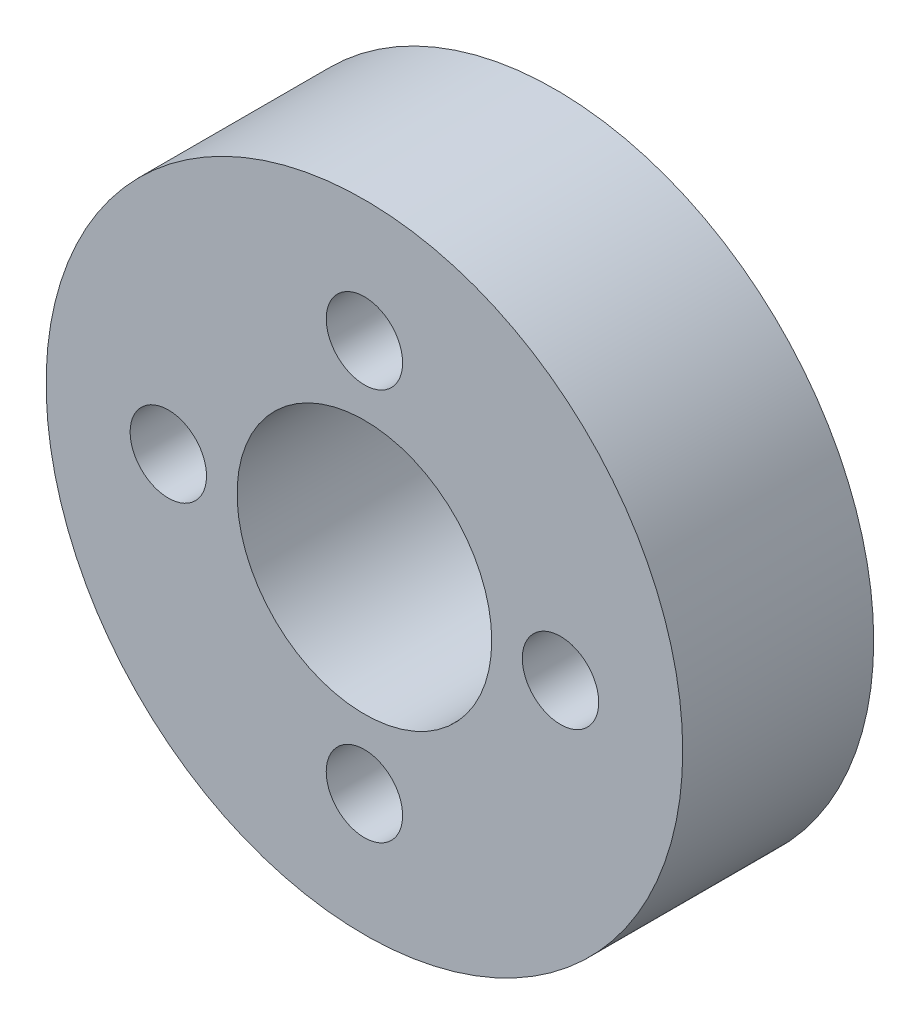
ISO-10303-21;
HEADER;
FILE_DESCRIPTION(('STEP AP214'),'2;1');
FILE_NAME('part.step','',(''),(''),'','','');
FILE_SCHEMA(('AUTOMOTIVE_DESIGN { 1 0 10303 214 1 1 1 1 }'));
ENDSEC;
DATA;
#1=APPLICATION_CONTEXT('core data for automotive mechanical design processes');
#2=APPLICATION_PROTOCOL_DEFINITION('international standard','automotive_design',2000,#1);
#3=PRODUCT_CONTEXT('',#1,'mechanical');
#4=PRODUCT('Part','Part','',(#3));
#5=PRODUCT_RELATED_PRODUCT_CATEGORY('part','',(#4));
#6=PRODUCT_DEFINITION_FORMATION('','',#4);
#7=PRODUCT_DEFINITION_CONTEXT('part definition',#1,'design');
#8=PRODUCT_DEFINITION('design','',#6,#7);
#9=PRODUCT_DEFINITION_SHAPE('','',#8);
#10=(LENGTH_UNIT() NAMED_UNIT(*) SI_UNIT(.MILLI.,.METRE.));
#11=(NAMED_UNIT(*) PLANE_ANGLE_UNIT() SI_UNIT($,.RADIAN.));
#12=(NAMED_UNIT(*) SI_UNIT($,.STERADIAN.) SOLID_ANGLE_UNIT());
#13=UNCERTAINTY_MEASURE_WITH_UNIT(LENGTH_MEASURE(1.E-05),#10,'distance_accuracy_value','');
#14=(GEOMETRIC_REPRESENTATION_CONTEXT(3) GLOBAL_UNCERTAINTY_ASSIGNED_CONTEXT((#13)) GLOBAL_UNIT_ASSIGNED_CONTEXT((#10,
#11,#12)) REPRESENTATION_CONTEXT('',''));
#15=CARTESIAN_POINT('',(0.,0.,0.));
#16=DIRECTION('',(0.,0.,1.));
#17=DIRECTION('',(1.,0.,0.));
#18=AXIS2_PLACEMENT_3D('',#15,#16,#17);
#19=CARTESIAN_POINT('',(0.,0.,9.525));
#20=DIRECTION('',(0.,0.,1.));
#21=DIRECTION('',(1.,0.,0.));
#22=AXIS2_PLACEMENT_3D('',#19,#20,#21);
#23=PLANE('',#22);
#24=CARTESIAN_POINT('',(-9.779,0.,9.525));
#25=DIRECTION('',(0.,0.,1.));
#26=DIRECTION('',(0.,1.,0.));
#27=AXIS2_PLACEMENT_3D('',#24,#25,#26);
#28=CIRCLE('',#27,1.905);
#29=CARTESIAN_POINT('',(-9.77900000000001,1.90499999999997,9.525));
#30=VERTEX_POINT('',#29);
#31=EDGE_CURVE('E68',#30,#30,#28,.T.);
#32=ORIENTED_EDGE('',*,*,#31,.F.);
#33=EDGE_LOOP('',(#32));
#34=FACE_BOUND('',#33,.T.);
#35=CARTESIAN_POINT('',(0.,-9.779,9.525));
#36=DIRECTION('',(0.,0.,1.));
#37=DIRECTION('',(-1.,0.,0.));
#38=AXIS2_PLACEMENT_3D('',#35,#36,#37);
#39=CIRCLE('',#38,1.905);
#40=CARTESIAN_POINT('',(-1.905,-9.779,9.525));
#41=VERTEX_POINT('',#40);
#42=EDGE_CURVE('E62',#41,#41,#39,.T.);
#43=ORIENTED_EDGE('',*,*,#42,.F.);
#44=EDGE_LOOP('',(#43));
#45=FACE_BOUND('',#44,.T.);
#46=CARTESIAN_POINT('',(9.779,1.02429588037641E-13,9.525));
#47=DIRECTION('',(0.,0.,1.));
#48=DIRECTION('',(0.,-1.,0.));
#49=AXIS2_PLACEMENT_3D('',#46,#47,#48);
#50=CIRCLE('',#49,1.905);
#51=CARTESIAN_POINT('',(9.77900000000002,-1.9049999999999,9.525));
#52=VERTEX_POINT('',#51);
#53=EDGE_CURVE('E56',#52,#52,#50,.T.);
#54=ORIENTED_EDGE('',*,*,#53,.F.);
#55=EDGE_LOOP('',(#54));
#56=FACE_BOUND('',#55,.T.);
#57=CARTESIAN_POINT('',(0.,9.779,9.525));
#58=DIRECTION('',(0.,0.,1.));
#59=DIRECTION('',(1.,0.,0.));
#60=AXIS2_PLACEMENT_3D('',#57,#58,#59);
#61=CIRCLE('',#60,1.905);
#62=CARTESIAN_POINT('',(1.905,9.779,9.525));
#63=VERTEX_POINT('',#62);
#64=EDGE_CURVE('E50',#63,#63,#61,.T.);
#65=ORIENTED_EDGE('',*,*,#64,.F.);
#66=EDGE_LOOP('',(#65));
#67=FACE_BOUND('',#66,.T.);
#68=CARTESIAN_POINT('',(0.,0.,9.525));
#69=DIRECTION('',(0.,0.,1.));
#70=DIRECTION('',(1.,0.,0.));
#71=AXIS2_PLACEMENT_3D('',#68,#69,#70);
#72=CIRCLE('',#71,15.875);
#73=CARTESIAN_POINT('',(15.875,0.,9.525));
#74=VERTEX_POINT('',#73);
#75=EDGE_CURVE('E10',#74,#74,#72,.T.);
#76=ORIENTED_EDGE('',*,*,#75,.T.);
#77=EDGE_LOOP('',(#76));
#78=FACE_BOUND('',#77,.T.);
#79=CARTESIAN_POINT('',(0.,0.,9.525));
#80=DIRECTION('',(0.,0.,1.));
#81=DIRECTION('',(1.,0.,0.));
#82=AXIS2_PLACEMENT_3D('',#79,#80,#81);
#83=CIRCLE('',#82,6.35);
#84=CARTESIAN_POINT('',(6.35,0.,9.525));
#85=VERTEX_POINT('',#84);
#86=EDGE_CURVE('E42',#85,#85,#83,.T.);
#87=ORIENTED_EDGE('',*,*,#86,.F.);
#88=EDGE_LOOP('',(#87));
#89=FACE_BOUND('',#88,.T.);
#90=ADVANCED_FACE('F31',(#34,#45,#56,#67,#78,#89),#23,.T.);
#91=CARTESIAN_POINT('',(0.,0.,0.));
#92=DIRECTION('',(0.,0.,1.));
#93=DIRECTION('',(1.,0.,0.));
#94=AXIS2_PLACEMENT_3D('',#91,#92,#93);
#95=PLANE('',#94);
#96=CARTESIAN_POINT('',(-9.779,0.,0.));
#97=DIRECTION('',(0.,0.,1.));
#98=DIRECTION('',(0.,1.,0.));
#99=AXIS2_PLACEMENT_3D('',#96,#97,#98);
#100=CIRCLE('',#99,1.905);
#101=CARTESIAN_POINT('',(-9.77900000000001,1.90499999999997,0.));
#102=VERTEX_POINT('',#101);
#103=EDGE_CURVE('E53',#102,#102,#100,.T.);
#104=ORIENTED_EDGE('',*,*,#103,.T.);
#105=EDGE_LOOP('',(#104));
#106=FACE_BOUND('',#105,.T.);
#107=CARTESIAN_POINT('',(0.,-9.779,0.));
#108=DIRECTION('',(0.,0.,1.));
#109=DIRECTION('',(-1.,0.,0.));
#110=AXIS2_PLACEMENT_3D('',#107,#108,#109);
#111=CIRCLE('',#110,1.905);
#112=CARTESIAN_POINT('',(-1.905,-9.779,0.));
#113=VERTEX_POINT('',#112);
#114=EDGE_CURVE('E65',#113,#113,#111,.T.);
#115=ORIENTED_EDGE('',*,*,#114,.T.);
#116=EDGE_LOOP('',(#115));
#117=FACE_BOUND('',#116,.T.);
#118=CARTESIAN_POINT('',(9.779,1.02429588037641E-13,0.));
#119=DIRECTION('',(0.,0.,1.));
#120=DIRECTION('',(0.,-1.,0.));
#121=AXIS2_PLACEMENT_3D('',#118,#119,#120);
#122=CIRCLE('',#121,1.905);
#123=CARTESIAN_POINT('',(9.77900000000002,-1.9049999999999,0.));
#124=VERTEX_POINT('',#123);
#125=EDGE_CURVE('E59',#124,#124,#122,.T.);
#126=ORIENTED_EDGE('',*,*,#125,.T.);
#127=EDGE_LOOP('',(#126));
#128=FACE_BOUND('',#127,.T.);
#129=CARTESIAN_POINT('',(0.,9.779,0.));
#130=DIRECTION('',(0.,0.,1.));
#131=DIRECTION('',(1.,0.,0.));
#132=AXIS2_PLACEMENT_3D('',#129,#130,#131);
#133=CIRCLE('',#132,1.905);
#134=CARTESIAN_POINT('',(1.905,9.779,0.));
#135=VERTEX_POINT('',#134);
#136=EDGE_CURVE('E47',#135,#135,#133,.T.);
#137=ORIENTED_EDGE('',*,*,#136,.T.);
#138=EDGE_LOOP('',(#137));
#139=FACE_BOUND('',#138,.T.);
#140=CARTESIAN_POINT('',(0.,0.,0.));
#141=DIRECTION('',(0.,0.,1.));
#142=DIRECTION('',(1.,0.,0.));
#143=AXIS2_PLACEMENT_3D('',#140,#141,#142);
#144=CIRCLE('',#143,15.875);
#145=CARTESIAN_POINT('',(15.875,0.,0.));
#146=VERTEX_POINT('',#145);
#147=EDGE_CURVE('E35',#146,#146,#144,.T.);
#148=ORIENTED_EDGE('',*,*,#147,.F.);
#149=EDGE_LOOP('',(#148));
#150=FACE_BOUND('',#149,.T.);
#151=CARTESIAN_POINT('',(0.,0.,0.));
#152=DIRECTION('',(0.,0.,1.));
#153=DIRECTION('',(1.,0.,0.));
#154=AXIS2_PLACEMENT_3D('',#151,#152,#153);
#155=CIRCLE('',#154,6.35);
#156=CARTESIAN_POINT('',(6.35,0.,0.));
#157=VERTEX_POINT('',#156);
#158=EDGE_CURVE('E44',#157,#157,#155,.T.);
#159=ORIENTED_EDGE('',*,*,#158,.T.);
#160=EDGE_LOOP('',(#159));
#161=FACE_BOUND('',#160,.T.);
#162=ADVANCED_FACE('F74',(#106,#117,#128,#139,#150,#161),#95,.F.);
#163=CARTESIAN_POINT('',(0.,0.,9.525));
#164=DIRECTION('',(0.,0.,-1.));
#165=DIRECTION('',(-1.,0.,0.));
#166=AXIS2_PLACEMENT_3D('',#163,#164,#165);
#167=CYLINDRICAL_SURFACE('',#166,15.875);
#168=ORIENTED_EDGE('',*,*,#75,.F.);
#169=EDGE_LOOP('',(#168));
#170=FACE_BOUND('',#169,.T.);
#171=ORIENTED_EDGE('',*,*,#147,.T.);
#172=EDGE_LOOP('',(#171));
#173=FACE_BOUND('',#172,.T.);
#174=ADVANCED_FACE('F33',(#170,#173),#167,.T.);
#175=CARTESIAN_POINT('',(0.,0.,9.525));
#176=DIRECTION('',(0.,0.,-1.));
#177=DIRECTION('',(-1.,0.,0.));
#178=AXIS2_PLACEMENT_3D('',#175,#176,#177);
#179=CYLINDRICAL_SURFACE('',#178,6.35);
#180=ORIENTED_EDGE('',*,*,#86,.T.);
#181=EDGE_LOOP('',(#180));
#182=FACE_BOUND('',#181,.T.);
#183=ORIENTED_EDGE('',*,*,#158,.F.);
#184=EDGE_LOOP('',(#183));
#185=FACE_BOUND('',#184,.T.);
#186=ADVANCED_FACE('F95',(#182,#185),#179,.F.);
#187=CARTESIAN_POINT('',(0.,9.779,0.));
#188=DIRECTION('',(0.,0.,1.));
#189=DIRECTION('',(1.,0.,0.));
#190=AXIS2_PLACEMENT_3D('',#187,#188,#189);
#191=CYLINDRICAL_SURFACE('',#190,1.905);
#192=ORIENTED_EDGE('',*,*,#136,.F.);
#193=EDGE_LOOP('',(#192));
#194=FACE_BOUND('',#193,.T.);
#195=ORIENTED_EDGE('',*,*,#64,.T.);
#196=EDGE_LOOP('',(#195));
#197=FACE_BOUND('',#196,.T.);
#198=ADVANCED_FACE('F98',(#194,#197),#191,.F.);
#199=CARTESIAN_POINT('',(9.779,1.02429588037641E-13,0.));
#200=DIRECTION('',(0.,0.,1.));
#201=DIRECTION('',(1.,0.,0.));
#202=AXIS2_PLACEMENT_3D('',#199,#200,#201);
#203=CYLINDRICAL_SURFACE('',#202,1.905);
#204=ORIENTED_EDGE('',*,*,#125,.F.);
#205=EDGE_LOOP('',(#204));
#206=FACE_BOUND('',#205,.T.);
#207=ORIENTED_EDGE('',*,*,#53,.T.);
#208=EDGE_LOOP('',(#207));
#209=FACE_BOUND('',#208,.T.);
#210=ADVANCED_FACE('F110',(#206,#209),#203,.F.);
#211=CARTESIAN_POINT('',(0.,-9.779,0.));
#212=DIRECTION('',(0.,0.,1.));
#213=DIRECTION('',(1.,0.,0.));
#214=AXIS2_PLACEMENT_3D('',#211,#212,#213);
#215=CYLINDRICAL_SURFACE('',#214,1.905);
#216=ORIENTED_EDGE('',*,*,#114,.F.);
#217=EDGE_LOOP('',(#216));
#218=FACE_BOUND('',#217,.T.);
#219=ORIENTED_EDGE('',*,*,#42,.T.);
#220=EDGE_LOOP('',(#219));
#221=FACE_BOUND('',#220,.T.);
#222=ADVANCED_FACE('F80',(#218,#221),#215,.F.);
#223=CARTESIAN_POINT('',(-9.779,0.,0.));
#224=DIRECTION('',(0.,0.,1.));
#225=DIRECTION('',(1.,0.,0.));
#226=AXIS2_PLACEMENT_3D('',#223,#224,#225);
#227=CYLINDRICAL_SURFACE('',#226,1.905);
#228=ORIENTED_EDGE('',*,*,#103,.F.);
#229=EDGE_LOOP('',(#228));
#230=FACE_BOUND('',#229,.T.);
#231=ORIENTED_EDGE('',*,*,#31,.T.);
#232=EDGE_LOOP('',(#231));
#233=FACE_BOUND('',#232,.T.);
#234=ADVANCED_FACE('F77',(#230,#233),#227,.F.);
#235=CLOSED_SHELL('',(#90,#162,#174,#186,#198,#210,#222,#234));
#236=MANIFOLD_SOLID_BREP('B2',#235);
#237=ADVANCED_BREP_SHAPE_REPRESENTATION('',(#18,#236),#14);
#238=SHAPE_DEFINITION_REPRESENTATION(#9,#237);
ENDSEC;
END-ISO-10303-21;
